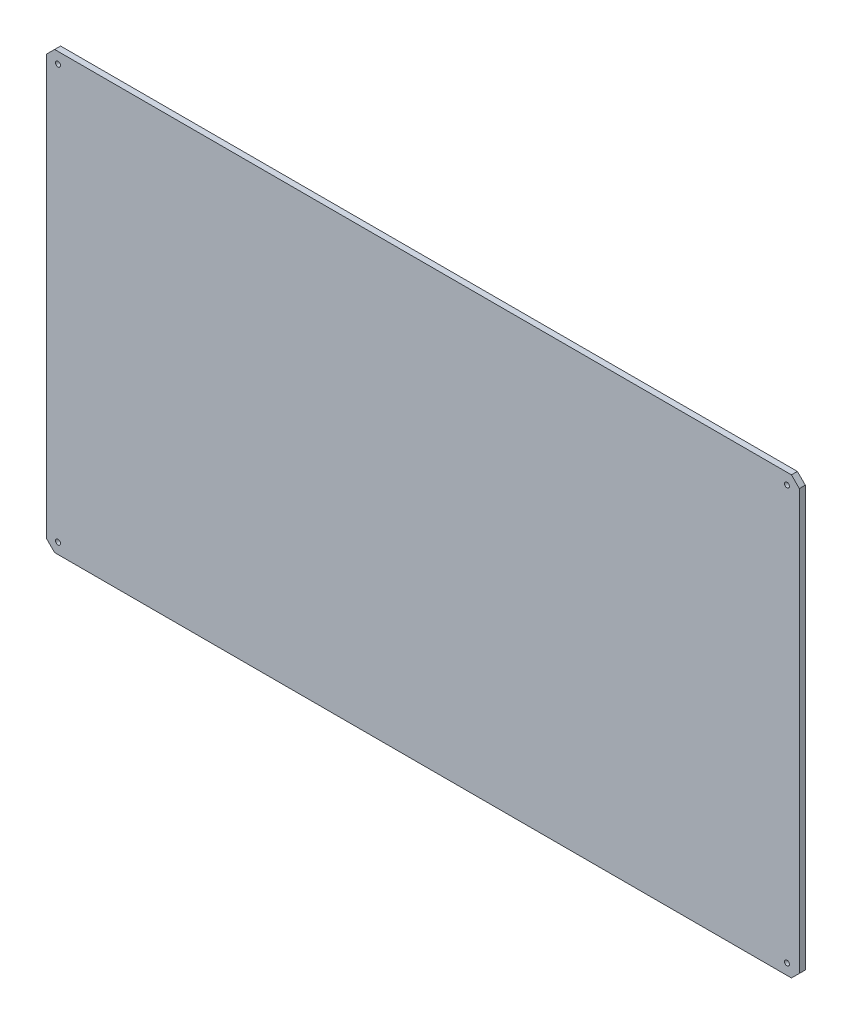
ISO-10303-21;
HEADER;
FILE_DESCRIPTION(('STEP AP214'),'2;1');
FILE_NAME('part.step','',(''),(''),'','','');
FILE_SCHEMA(('AUTOMOTIVE_DESIGN { 1 0 10303 214 1 1 1 1 }'));
ENDSEC;
DATA;
#1=APPLICATION_CONTEXT('core data for automotive mechanical design processes');
#2=APPLICATION_PROTOCOL_DEFINITION('international standard','automotive_design',2000,#1);
#3=PRODUCT_CONTEXT('',#1,'mechanical');
#4=PRODUCT('Part','Part','',(#3));
#5=PRODUCT_RELATED_PRODUCT_CATEGORY('part','',(#4));
#6=PRODUCT_DEFINITION_FORMATION('','',#4);
#7=PRODUCT_DEFINITION_CONTEXT('part definition',#1,'design');
#8=PRODUCT_DEFINITION('design','',#6,#7);
#9=PRODUCT_DEFINITION_SHAPE('','',#8);
#10=(LENGTH_UNIT() NAMED_UNIT(*) SI_UNIT(.MILLI.,.METRE.));
#11=(NAMED_UNIT(*) PLANE_ANGLE_UNIT() SI_UNIT($,.RADIAN.));
#12=(NAMED_UNIT(*) SI_UNIT($,.STERADIAN.) SOLID_ANGLE_UNIT());
#13=UNCERTAINTY_MEASURE_WITH_UNIT(LENGTH_MEASURE(1.E-05),#10,'distance_accuracy_value','');
#14=(GEOMETRIC_REPRESENTATION_CONTEXT(3) GLOBAL_UNCERTAINTY_ASSIGNED_CONTEXT((#13)) GLOBAL_UNIT_ASSIGNED_CONTEXT((#10,
#11,#12)) REPRESENTATION_CONTEXT('',''));
#15=CARTESIAN_POINT('',(0.,0.,0.));
#16=DIRECTION('',(0.,0.,1.));
#17=DIRECTION('',(1.,0.,0.));
#18=AXIS2_PLACEMENT_3D('',#15,#16,#17);
#19=CARTESIAN_POINT('',(200.,110.,3.));
#20=DIRECTION('',(0.,-1.,0.));
#21=DIRECTION('',(1.,0.,0.));
#22=AXIS2_PLACEMENT_3D('',#19,#20,#21);
#23=PLANE('',#22);
#24=DIRECTION('',(-1.,0.,0.));
#25=VECTOR('',#24,1.);
#26=CARTESIAN_POINT('',(200.,110.,3.));
#27=LINE('',#26,#25);
#28=CARTESIAN_POINT('',(196.,110.,3.));
#29=VERTEX_POINT('',#28);
#30=CARTESIAN_POINT('',(-176.,110.,3.));
#31=VERTEX_POINT('',#30);
#32=EDGE_CURVE('E128',#29,#31,#27,.T.);
#33=ORIENTED_EDGE('',*,*,#32,.F.);
#34=DIRECTION('',(0.,0.,-1.));
#35=VECTOR('',#34,1.);
#36=CARTESIAN_POINT('',(196.,110.,3.));
#37=LINE('',#36,#35);
#38=CARTESIAN_POINT('',(196.,110.,0.));
#39=VERTEX_POINT('',#38);
#40=EDGE_CURVE('E11',#29,#39,#37,.T.);
#41=ORIENTED_EDGE('',*,*,#40,.T.);
#42=DIRECTION('',(-1.,0.,0.));
#43=VECTOR('',#42,1.);
#44=CARTESIAN_POINT('',(200.,110.,0.));
#45=LINE('',#44,#43);
#46=CARTESIAN_POINT('',(-176.,110.,0.));
#47=VERTEX_POINT('',#46);
#48=EDGE_CURVE('E130',#39,#47,#45,.T.);
#49=ORIENTED_EDGE('',*,*,#48,.T.);
#50=DIRECTION('',(0.,0.,1.));
#51=VECTOR('',#50,1.);
#52=CARTESIAN_POINT('',(-176.,110.,3.));
#53=LINE('',#52,#51);
#54=EDGE_CURVE('E41',#47,#31,#53,.T.);
#55=ORIENTED_EDGE('',*,*,#54,.T.);
#56=EDGE_LOOP('',(#33,#41,#49,#55));
#57=FACE_BOUND('',#56,.T.);
#58=ADVANCED_FACE('F33',(#57),#23,.F.);
#59=CARTESIAN_POINT('',(-180.,-110.,3.));
#60=DIRECTION('',(1.,0.,0.));
#61=DIRECTION('',(0.,0.,-1.));
#62=AXIS2_PLACEMENT_3D('',#59,#60,#61);
#63=PLANE('',#62);
#64=DIRECTION('',(0.,-1.,0.));
#65=VECTOR('',#64,1.);
#66=CARTESIAN_POINT('',(-180.,-110.,0.));
#67=LINE('',#66,#65);
#68=CARTESIAN_POINT('',(-180.,106.,0.));
#69=VERTEX_POINT('',#68);
#70=CARTESIAN_POINT('',(-180.,-106.,0.));
#71=VERTEX_POINT('',#70);
#72=EDGE_CURVE('E126',#69,#71,#67,.T.);
#73=ORIENTED_EDGE('',*,*,#72,.T.);
#74=DIRECTION('',(0.,0.,1.));
#75=VECTOR('',#74,1.);
#76=CARTESIAN_POINT('',(-180.,-106.,3.));
#77=LINE('',#76,#75);
#78=CARTESIAN_POINT('',(-180.,-106.,3.));
#79=VERTEX_POINT('',#78);
#80=EDGE_CURVE('E105',#71,#79,#77,.T.);
#81=ORIENTED_EDGE('',*,*,#80,.T.);
#82=DIRECTION('',(0.,-1.,0.));
#83=VECTOR('',#82,1.);
#84=CARTESIAN_POINT('',(-180.,-110.,3.));
#85=LINE('',#84,#83);
#86=CARTESIAN_POINT('',(-180.,106.,3.));
#87=VERTEX_POINT('',#86);
#88=EDGE_CURVE('E182',#87,#79,#85,.T.);
#89=ORIENTED_EDGE('',*,*,#88,.F.);
#90=DIRECTION('',(0.,0.,-1.));
#91=VECTOR('',#90,1.);
#92=CARTESIAN_POINT('',(-180.,106.,3.));
#93=LINE('',#92,#91);
#94=EDGE_CURVE('E110',#87,#69,#93,.T.);
#95=ORIENTED_EDGE('',*,*,#94,.T.);
#96=EDGE_LOOP('',(#73,#81,#89,#95));
#97=FACE_BOUND('',#96,.T.);
#98=ADVANCED_FACE('F186',(#97),#63,.F.);
#99=CARTESIAN_POINT('',(200.,-110.,3.));
#100=DIRECTION('',(0.,1.,0.));
#101=DIRECTION('',(-1.,0.,0.));
#102=AXIS2_PLACEMENT_3D('',#99,#100,#101);
#103=PLANE('',#102);
#104=DIRECTION('',(1.,0.,0.));
#105=VECTOR('',#104,1.);
#106=CARTESIAN_POINT('',(200.,-110.,3.));
#107=LINE('',#106,#105);
#108=CARTESIAN_POINT('',(-176.,-110.,3.));
#109=VERTEX_POINT('',#108);
#110=CARTESIAN_POINT('',(196.,-110.,3.));
#111=VERTEX_POINT('',#110);
#112=EDGE_CURVE('E119',#109,#111,#107,.T.);
#113=ORIENTED_EDGE('',*,*,#112,.F.);
#114=DIRECTION('',(0.,0.,-1.));
#115=VECTOR('',#114,1.);
#116=CARTESIAN_POINT('',(-176.,-110.,3.));
#117=LINE('',#116,#115);
#118=CARTESIAN_POINT('',(-176.,-110.,0.));
#119=VERTEX_POINT('',#118);
#120=EDGE_CURVE('E104',#109,#119,#117,.T.);
#121=ORIENTED_EDGE('',*,*,#120,.T.);
#122=DIRECTION('',(1.,0.,0.));
#123=VECTOR('',#122,1.);
#124=CARTESIAN_POINT('',(200.,-110.,0.));
#125=LINE('',#124,#123);
#126=CARTESIAN_POINT('',(196.,-110.,0.));
#127=VERTEX_POINT('',#126);
#128=EDGE_CURVE('E117',#119,#127,#125,.T.);
#129=ORIENTED_EDGE('',*,*,#128,.T.);
#130=DIRECTION('',(0.,0.,1.));
#131=VECTOR('',#130,1.);
#132=CARTESIAN_POINT('',(196.,-110.,3.));
#133=LINE('',#132,#131);
#134=EDGE_CURVE('E121',#127,#111,#133,.T.);
#135=ORIENTED_EDGE('',*,*,#134,.T.);
#136=EDGE_LOOP('',(#113,#121,#129,#135));
#137=FACE_BOUND('',#136,.T.);
#138=ADVANCED_FACE('F116',(#137),#103,.F.);
#139=CARTESIAN_POINT('',(200.,-110.,3.));
#140=DIRECTION('',(-1.,0.,0.));
#141=DIRECTION('',(0.,0.,1.));
#142=AXIS2_PLACEMENT_3D('',#139,#140,#141);
#143=PLANE('',#142);
#144=DIRECTION('',(0.,1.,0.));
#145=VECTOR('',#144,1.);
#146=CARTESIAN_POINT('',(200.,-110.,3.));
#147=LINE('',#146,#145);
#148=CARTESIAN_POINT('',(200.,-106.,3.));
#149=VERTEX_POINT('',#148);
#150=CARTESIAN_POINT('',(200.,106.,3.));
#151=VERTEX_POINT('',#150);
#152=EDGE_CURVE('E150',#149,#151,#147,.T.);
#153=ORIENTED_EDGE('',*,*,#152,.F.);
#154=DIRECTION('',(0.,0.,-1.));
#155=VECTOR('',#154,1.);
#156=CARTESIAN_POINT('',(200.,-106.,3.));
#157=LINE('',#156,#155);
#158=CARTESIAN_POINT('',(200.,-106.,0.));
#159=VERTEX_POINT('',#158);
#160=EDGE_CURVE('E167',#149,#159,#157,.T.);
#161=ORIENTED_EDGE('',*,*,#160,.T.);
#162=DIRECTION('',(0.,1.,0.));
#163=VECTOR('',#162,1.);
#164=CARTESIAN_POINT('',(200.,-110.,0.));
#165=LINE('',#164,#163);
#166=CARTESIAN_POINT('',(200.,106.,0.));
#167=VERTEX_POINT('',#166);
#168=EDGE_CURVE('E125',#159,#167,#165,.T.);
#169=ORIENTED_EDGE('',*,*,#168,.T.);
#170=DIRECTION('',(0.,0.,1.));
#171=VECTOR('',#170,1.);
#172=CARTESIAN_POINT('',(200.,106.,3.));
#173=LINE('',#172,#171);
#174=EDGE_CURVE('E48',#167,#151,#173,.T.);
#175=ORIENTED_EDGE('',*,*,#174,.T.);
#176=EDGE_LOOP('',(#153,#161,#169,#175));
#177=FACE_BOUND('',#176,.T.);
#178=ADVANCED_FACE('F204',(#177),#143,.F.);
#179=CARTESIAN_POINT('',(0.,0.,3.));
#180=DIRECTION('',(0.,0.,-1.));
#181=DIRECTION('',(-1.,0.,0.));
#182=AXIS2_PLACEMENT_3D('',#179,#180,#181);
#183=PLANE('',#182);
#184=CARTESIAN_POINT('',(193.72166283323,104.43934373138,3.));
#185=DIRECTION('',(0.,0.,1.));
#186=DIRECTION('',(1.,0.,0.));
#187=AXIS2_PLACEMENT_3D('',#184,#185,#186);
#188=CIRCLE('',#187,1.24999999999995);
#189=CARTESIAN_POINT('',(194.97166283323,104.43934373138,3.));
#190=VERTEX_POINT('',#189);
#191=EDGE_CURVE('E149',#190,#190,#188,.T.);
#192=ORIENTED_EDGE('',*,*,#191,.F.);
#193=EDGE_LOOP('',(#192));
#194=FACE_BOUND('',#193,.T.);
#195=CARTESIAN_POINT('',(193.721662833231,-104.56065626862,3.));
#196=DIRECTION('',(0.,0.,1.));
#197=DIRECTION('',(1.,0.,0.));
#198=AXIS2_PLACEMENT_3D('',#195,#196,#197);
#199=CIRCLE('',#198,1.25000000000001);
#200=CARTESIAN_POINT('',(194.971662833231,-104.56065626862,3.));
#201=VERTEX_POINT('',#200);
#202=EDGE_CURVE('E145',#201,#201,#199,.T.);
#203=ORIENTED_EDGE('',*,*,#202,.F.);
#204=EDGE_LOOP('',(#203));
#205=FACE_BOUND('',#204,.T.);
#206=CARTESIAN_POINT('',(-174.278337166769,104.439343731379,3.));
#207=DIRECTION('',(0.,0.,1.));
#208=DIRECTION('',(1.,0.,0.));
#209=AXIS2_PLACEMENT_3D('',#206,#207,#208);
#210=CIRCLE('',#209,1.25000000000001);
#211=CARTESIAN_POINT('',(-173.028337166769,104.439343731379,3.));
#212=VERTEX_POINT('',#211);
#213=EDGE_CURVE('E141',#212,#212,#210,.T.);
#214=ORIENTED_EDGE('',*,*,#213,.F.);
#215=EDGE_LOOP('',(#214));
#216=FACE_BOUND('',#215,.T.);
#217=CARTESIAN_POINT('',(-174.278337166769,-104.560656268621,3.));
#218=DIRECTION('',(0.,0.,1.));
#219=DIRECTION('',(1.,0.,0.));
#220=AXIS2_PLACEMENT_3D('',#217,#218,#219);
#221=CIRCLE('',#220,1.25000000000001);
#222=CARTESIAN_POINT('',(-173.028337166769,-104.560656268621,3.));
#223=VERTEX_POINT('',#222);
#224=EDGE_CURVE('E137',#223,#223,#221,.T.);
#225=ORIENTED_EDGE('',*,*,#224,.F.);
#226=EDGE_LOOP('',(#225));
#227=FACE_BOUND('',#226,.T.);
#228=ORIENTED_EDGE('',*,*,#88,.T.);
#229=DIRECTION('',(-0.707106781186543,0.707106781186552,0.));
#230=VECTOR('',#229,1.);
#231=CARTESIAN_POINT('',(-176.,-110.,3.));
#232=LINE('',#231,#230);
#233=EDGE_CURVE('E164',#79,#109,#232,.F.);
#234=ORIENTED_EDGE('',*,*,#233,.T.);
#235=ORIENTED_EDGE('',*,*,#112,.T.);
#236=DIRECTION('',(-0.707106781186552,-0.707106781186543,0.));
#237=VECTOR('',#236,1.);
#238=CARTESIAN_POINT('',(200.,-106.,3.));
#239=LINE('',#238,#237);
#240=EDGE_CURVE('E55',#111,#149,#239,.F.);
#241=ORIENTED_EDGE('',*,*,#240,.T.);
#242=ORIENTED_EDGE('',*,*,#152,.T.);
#243=DIRECTION('',(0.707106781186543,-0.707106781186552,0.));
#244=VECTOR('',#243,1.);
#245=CARTESIAN_POINT('',(196.,110.,3.));
#246=LINE('',#245,#244);
#247=EDGE_CURVE('E161',#151,#29,#246,.F.);
#248=ORIENTED_EDGE('',*,*,#247,.T.);
#249=ORIENTED_EDGE('',*,*,#32,.T.);
#250=DIRECTION('',(0.707106781186552,0.707106781186543,0.));
#251=VECTOR('',#250,1.);
#252=CARTESIAN_POINT('',(-180.,106.,3.));
#253=LINE('',#252,#251);
#254=EDGE_CURVE('E159',#31,#87,#253,.F.);
#255=ORIENTED_EDGE('',*,*,#254,.T.);
#256=EDGE_LOOP('',(#228,#234,#235,#241,#242,#248,#249,#255));
#257=FACE_BOUND('',#256,.T.);
#258=ADVANCED_FACE('F179',(#194,#205,#216,#227,#257),#183,.F.);
#259=CARTESIAN_POINT('',(0.,0.,0.));
#260=DIRECTION('',(0.,0.,-1.));
#261=DIRECTION('',(-1.,0.,0.));
#262=AXIS2_PLACEMENT_3D('',#259,#260,#261);
#263=PLANE('',#262);
#264=CARTESIAN_POINT('',(193.72166283323,104.43934373138,0.));
#265=DIRECTION('',(0.,0.,-1.));
#266=DIRECTION('',(-1.,0.,0.));
#267=AXIS2_PLACEMENT_3D('',#264,#265,#266);
#268=CIRCLE('',#267,1.24999999999995);
#269=CARTESIAN_POINT('',(192.471662833231,104.43934373138,0.));
#270=VERTEX_POINT('',#269);
#271=EDGE_CURVE('E146',#270,#270,#268,.T.);
#272=ORIENTED_EDGE('',*,*,#271,.F.);
#273=EDGE_LOOP('',(#272));
#274=FACE_BOUND('',#273,.T.);
#275=CARTESIAN_POINT('',(193.721662833231,-104.56065626862,0.));
#276=DIRECTION('',(0.,0.,-1.));
#277=DIRECTION('',(-1.,0.,0.));
#278=AXIS2_PLACEMENT_3D('',#275,#276,#277);
#279=CIRCLE('',#278,1.25000000000001);
#280=CARTESIAN_POINT('',(192.471662833231,-104.56065626862,0.));
#281=VERTEX_POINT('',#280);
#282=EDGE_CURVE('E142',#281,#281,#279,.T.);
#283=ORIENTED_EDGE('',*,*,#282,.F.);
#284=EDGE_LOOP('',(#283));
#285=FACE_BOUND('',#284,.T.);
#286=CARTESIAN_POINT('',(-174.278337166769,104.439343731379,0.));
#287=DIRECTION('',(0.,0.,-1.));
#288=DIRECTION('',(-1.,0.,0.));
#289=AXIS2_PLACEMENT_3D('',#286,#287,#288);
#290=CIRCLE('',#289,1.25000000000001);
#291=CARTESIAN_POINT('',(-175.528337166769,104.439343731379,0.));
#292=VERTEX_POINT('',#291);
#293=EDGE_CURVE('E138',#292,#292,#290,.T.);
#294=ORIENTED_EDGE('',*,*,#293,.F.);
#295=EDGE_LOOP('',(#294));
#296=FACE_BOUND('',#295,.T.);
#297=CARTESIAN_POINT('',(-174.278337166769,-104.560656268621,0.));
#298=DIRECTION('',(0.,0.,-1.));
#299=DIRECTION('',(-1.,0.,0.));
#300=AXIS2_PLACEMENT_3D('',#297,#298,#299);
#301=CIRCLE('',#300,1.25000000000001);
#302=CARTESIAN_POINT('',(-175.528337166769,-104.560656268621,0.));
#303=VERTEX_POINT('',#302);
#304=EDGE_CURVE('E134',#303,#303,#301,.T.);
#305=ORIENTED_EDGE('',*,*,#304,.F.);
#306=EDGE_LOOP('',(#305));
#307=FACE_BOUND('',#306,.T.);
#308=ORIENTED_EDGE('',*,*,#128,.F.);
#309=DIRECTION('',(0.707106781186543,-0.707106781186552,0.));
#310=VECTOR('',#309,1.);
#311=CARTESIAN_POINT('',(-143.000000000001,-142.999999999999,0.));
#312=LINE('',#311,#310);
#313=EDGE_CURVE('E100',#119,#71,#312,.F.);
#314=ORIENTED_EDGE('',*,*,#313,.T.);
#315=ORIENTED_EDGE('',*,*,#72,.F.);
#316=DIRECTION('',(-0.707106781186552,-0.707106781186543,0.));
#317=VECTOR('',#316,1.);
#318=CARTESIAN_POINT('',(-142.999999999999,143.000000000001,0.));
#319=LINE('',#318,#317);
#320=EDGE_CURVE('E120',#69,#47,#319,.F.);
#321=ORIENTED_EDGE('',*,*,#320,.T.);
#322=ORIENTED_EDGE('',*,*,#48,.F.);
#323=DIRECTION('',(-0.707106781186543,0.707106781186552,0.));
#324=VECTOR('',#323,1.);
#325=CARTESIAN_POINT('',(153.000000000001,152.999999999999,0.));
#326=LINE('',#325,#324);
#327=EDGE_CURVE('E153',#39,#167,#326,.F.);
#328=ORIENTED_EDGE('',*,*,#327,.T.);
#329=ORIENTED_EDGE('',*,*,#168,.F.);
#330=DIRECTION('',(0.707106781186552,0.707106781186543,0.));
#331=VECTOR('',#330,1.);
#332=CARTESIAN_POINT('',(152.999999999999,-153.000000000001,0.));
#333=LINE('',#332,#331);
#334=EDGE_CURVE('E111',#159,#127,#333,.F.);
#335=ORIENTED_EDGE('',*,*,#334,.T.);
#336=EDGE_LOOP('',(#308,#314,#315,#321,#322,#328,#329,#335));
#337=FACE_BOUND('',#336,.T.);
#338=ADVANCED_FACE('F123',(#274,#285,#296,#307,#337),#263,.T.);
#339=CARTESIAN_POINT('',(-174.278337166769,-104.560656268621,-7.));
#340=DIRECTION('',(0.,0.,1.));
#341=DIRECTION('',(1.,0.,0.));
#342=AXIS2_PLACEMENT_3D('',#339,#340,#341);
#343=CYLINDRICAL_SURFACE('',#342,1.25000000000001);
#344=ORIENTED_EDGE('',*,*,#304,.T.);
#345=EDGE_LOOP('',(#344));
#346=FACE_BOUND('',#345,.T.);
#347=ORIENTED_EDGE('',*,*,#224,.T.);
#348=EDGE_LOOP('',(#347));
#349=FACE_BOUND('',#348,.T.);
#350=ADVANCED_FACE('F212',(#346,#349),#343,.F.);
#351=CARTESIAN_POINT('',(-174.278337166769,104.439343731379,-7.));
#352=DIRECTION('',(0.,0.,1.));
#353=DIRECTION('',(1.,0.,0.));
#354=AXIS2_PLACEMENT_3D('',#351,#352,#353);
#355=CYLINDRICAL_SURFACE('',#354,1.25000000000001);
#356=ORIENTED_EDGE('',*,*,#293,.T.);
#357=EDGE_LOOP('',(#356));
#358=FACE_BOUND('',#357,.T.);
#359=ORIENTED_EDGE('',*,*,#213,.T.);
#360=EDGE_LOOP('',(#359));
#361=FACE_BOUND('',#360,.T.);
#362=ADVANCED_FACE('F214',(#358,#361),#355,.F.);
#363=CARTESIAN_POINT('',(193.721662833231,-104.56065626862,-7.));
#364=DIRECTION('',(0.,0.,1.));
#365=DIRECTION('',(1.,0.,0.));
#366=AXIS2_PLACEMENT_3D('',#363,#364,#365);
#367=CYLINDRICAL_SURFACE('',#366,1.25000000000001);
#368=ORIENTED_EDGE('',*,*,#282,.T.);
#369=EDGE_LOOP('',(#368));
#370=FACE_BOUND('',#369,.T.);
#371=ORIENTED_EDGE('',*,*,#202,.T.);
#372=EDGE_LOOP('',(#371));
#373=FACE_BOUND('',#372,.T.);
#374=ADVANCED_FACE('F221',(#370,#373),#367,.F.);
#375=CARTESIAN_POINT('',(193.72166283323,104.43934373138,-7.));
#376=DIRECTION('',(0.,0.,1.));
#377=DIRECTION('',(1.,0.,0.));
#378=AXIS2_PLACEMENT_3D('',#375,#376,#377);
#379=CYLINDRICAL_SURFACE('',#378,1.24999999999995);
#380=ORIENTED_EDGE('',*,*,#271,.T.);
#381=EDGE_LOOP('',(#380));
#382=FACE_BOUND('',#381,.T.);
#383=ORIENTED_EDGE('',*,*,#191,.T.);
#384=EDGE_LOOP('',(#383));
#385=FACE_BOUND('',#384,.T.);
#386=ADVANCED_FACE('F200',(#382,#385),#379,.F.);
#387=CARTESIAN_POINT('',(-176.,-110.,3.));
#388=DIRECTION('',(0.707106781186552,0.707106781186543,0.));
#389=DIRECTION('',(0.,0.,-1.));
#390=AXIS2_PLACEMENT_3D('',#387,#388,#389);
#391=PLANE('',#390);
#392=ORIENTED_EDGE('',*,*,#233,.F.);
#393=ORIENTED_EDGE('',*,*,#80,.F.);
#394=ORIENTED_EDGE('',*,*,#313,.F.);
#395=ORIENTED_EDGE('',*,*,#120,.F.);
#396=EDGE_LOOP('',(#392,#393,#394,#395));
#397=FACE_BOUND('',#396,.T.);
#398=ADVANCED_FACE('F103',(#397),#391,.F.);
#399=CARTESIAN_POINT('',(200.,-106.,3.));
#400=DIRECTION('',(-0.707106781186543,0.707106781186552,0.));
#401=DIRECTION('',(0.,0.,-1.));
#402=AXIS2_PLACEMENT_3D('',#399,#400,#401);
#403=PLANE('',#402);
#404=ORIENTED_EDGE('',*,*,#240,.F.);
#405=ORIENTED_EDGE('',*,*,#134,.F.);
#406=ORIENTED_EDGE('',*,*,#334,.F.);
#407=ORIENTED_EDGE('',*,*,#160,.F.);
#408=EDGE_LOOP('',(#404,#405,#406,#407));
#409=FACE_BOUND('',#408,.T.);
#410=ADVANCED_FACE('F236',(#409),#403,.F.);
#411=CARTESIAN_POINT('',(196.,110.,3.));
#412=DIRECTION('',(-0.707106781186552,-0.707106781186543,0.));
#413=DIRECTION('',(0.,0.,-1.));
#414=AXIS2_PLACEMENT_3D('',#411,#412,#413);
#415=PLANE('',#414);
#416=ORIENTED_EDGE('',*,*,#247,.F.);
#417=ORIENTED_EDGE('',*,*,#174,.F.);
#418=ORIENTED_EDGE('',*,*,#327,.F.);
#419=ORIENTED_EDGE('',*,*,#40,.F.);
#420=EDGE_LOOP('',(#416,#417,#418,#419));
#421=FACE_BOUND('',#420,.T.);
#422=ADVANCED_FACE('F238',(#421),#415,.F.);
#423=CARTESIAN_POINT('',(-180.,106.,3.));
#424=DIRECTION('',(0.707106781186543,-0.707106781186552,0.));
#425=DIRECTION('',(0.,0.,-1.));
#426=AXIS2_PLACEMENT_3D('',#423,#424,#425);
#427=PLANE('',#426);
#428=ORIENTED_EDGE('',*,*,#254,.F.);
#429=ORIENTED_EDGE('',*,*,#54,.F.);
#430=ORIENTED_EDGE('',*,*,#320,.F.);
#431=ORIENTED_EDGE('',*,*,#94,.F.);
#432=EDGE_LOOP('',(#428,#429,#430,#431));
#433=FACE_BOUND('',#432,.T.);
#434=ADVANCED_FACE('F35',(#433),#427,.F.);
#435=CLOSED_SHELL('',(#58,#98,#138,#178,#258,#338,#350,#362,#374,#386,#398,#410,#422,#434));
#436=MANIFOLD_SOLID_BREP('B2',#435);
#437=ADVANCED_BREP_SHAPE_REPRESENTATION('',(#18,#436),#14);
#438=SHAPE_DEFINITION_REPRESENTATION(#9,#437);
ENDSEC;
END-ISO-10303-21;
